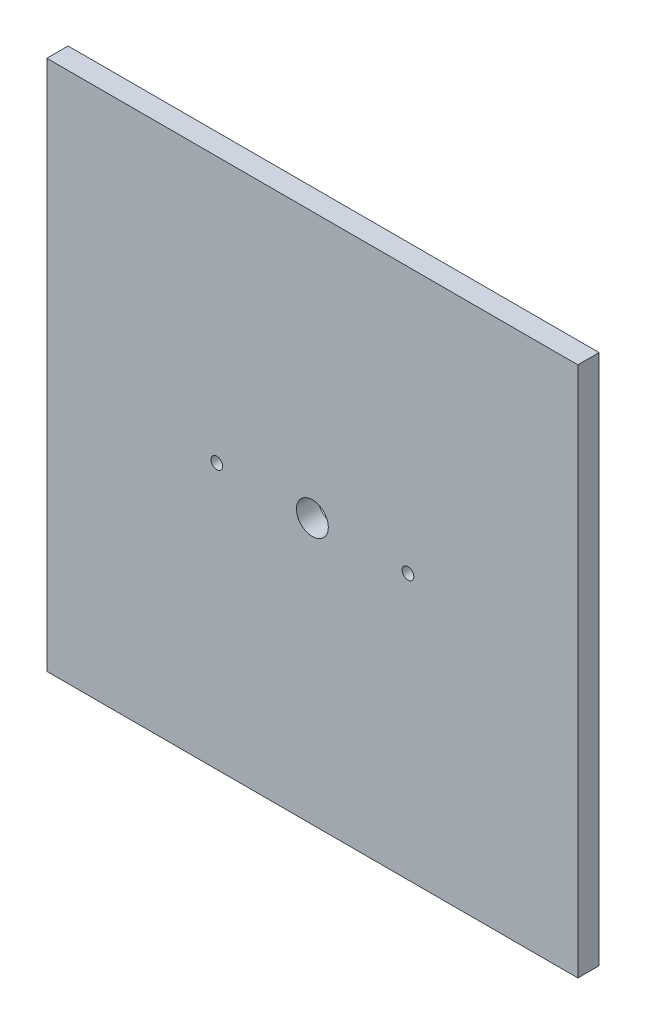
ISO-10303-21;
HEADER;
FILE_DESCRIPTION(('STEP AP214'),'2;1');
FILE_NAME('part.step','',(''),(''),'','','');
FILE_SCHEMA(('AUTOMOTIVE_DESIGN { 1 0 10303 214 1 1 1 1 }'));
ENDSEC;
DATA;
#1=APPLICATION_CONTEXT('core data for automotive mechanical design processes');
#2=APPLICATION_PROTOCOL_DEFINITION('international standard','automotive_design',2000,#1);
#3=PRODUCT_CONTEXT('',#1,'mechanical');
#4=PRODUCT('Part','Part','',(#3));
#5=PRODUCT_RELATED_PRODUCT_CATEGORY('part','',(#4));
#6=PRODUCT_DEFINITION_FORMATION('','',#4);
#7=PRODUCT_DEFINITION_CONTEXT('part definition',#1,'design');
#8=PRODUCT_DEFINITION('design','',#6,#7);
#9=PRODUCT_DEFINITION_SHAPE('','',#8);
#10=(LENGTH_UNIT() NAMED_UNIT(*) SI_UNIT(.MILLI.,.METRE.));
#11=(NAMED_UNIT(*) PLANE_ANGLE_UNIT() SI_UNIT($,.RADIAN.));
#12=(NAMED_UNIT(*) SI_UNIT($,.STERADIAN.) SOLID_ANGLE_UNIT());
#13=UNCERTAINTY_MEASURE_WITH_UNIT(LENGTH_MEASURE(1.E-05),#10,'distance_accuracy_value','');
#14=(GEOMETRIC_REPRESENTATION_CONTEXT(3) GLOBAL_UNCERTAINTY_ASSIGNED_CONTEXT((#13)) GLOBAL_UNIT_ASSIGNED_CONTEXT((#10,
#11,#12)) REPRESENTATION_CONTEXT('',''));
#15=CARTESIAN_POINT('',(0.,0.,0.));
#16=DIRECTION('',(0.,0.,1.));
#17=DIRECTION('',(1.,0.,0.));
#18=AXIS2_PLACEMENT_3D('',#15,#16,#17);
#19=CARTESIAN_POINT('',(-125.,-125.,10.));
#20=DIRECTION('',(1.,0.,0.));
#21=DIRECTION('',(0.,0.,-1.));
#22=AXIS2_PLACEMENT_3D('',#19,#20,#21);
#23=PLANE('',#22);
#24=DIRECTION('',(0.,-1.,0.));
#25=VECTOR('',#24,1.);
#26=CARTESIAN_POINT('',(-125.,-125.,0.));
#27=LINE('',#26,#25);
#28=CARTESIAN_POINT('',(-125.,125.,0.));
#29=VERTEX_POINT('',#28);
#30=CARTESIAN_POINT('',(-125.,-125.,0.));
#31=VERTEX_POINT('',#30);
#32=EDGE_CURVE('E107',#29,#31,#27,.T.);
#33=ORIENTED_EDGE('',*,*,#32,.T.);
#34=DIRECTION('',(0.,0.,-1.));
#35=VECTOR('',#34,1.);
#36=CARTESIAN_POINT('',(-125.,-125.,10.));
#37=LINE('',#36,#35);
#38=CARTESIAN_POINT('',(-125.,-125.,10.));
#39=VERTEX_POINT('',#38);
#40=EDGE_CURVE('E11',#39,#31,#37,.T.);
#41=ORIENTED_EDGE('',*,*,#40,.F.);
#42=DIRECTION('',(0.,-1.,0.));
#43=VECTOR('',#42,1.);
#44=CARTESIAN_POINT('',(-125.,-125.,10.));
#45=LINE('',#44,#43);
#46=CARTESIAN_POINT('',(-125.,125.,10.));
#47=VERTEX_POINT('',#46);
#48=EDGE_CURVE('E91',#47,#39,#45,.T.);
#49=ORIENTED_EDGE('',*,*,#48,.F.);
#50=DIRECTION('',(0.,0.,-1.));
#51=VECTOR('',#50,1.);
#52=CARTESIAN_POINT('',(-125.,125.,10.));
#53=LINE('',#52,#51);
#54=EDGE_CURVE('E103',#47,#29,#53,.T.);
#55=ORIENTED_EDGE('',*,*,#54,.T.);
#56=EDGE_LOOP('',(#33,#41,#49,#55));
#57=FACE_BOUND('',#56,.T.);
#58=ADVANCED_FACE('F39',(#57),#23,.F.);
#59=CARTESIAN_POINT('',(125.,-125.,10.));
#60=DIRECTION('',(0.,1.,0.));
#61=DIRECTION('',(0.,0.,1.));
#62=AXIS2_PLACEMENT_3D('',#59,#60,#61);
#63=PLANE('',#62);
#64=DIRECTION('',(1.,0.,0.));
#65=VECTOR('',#64,1.);
#66=CARTESIAN_POINT('',(125.,-125.,0.));
#67=LINE('',#66,#65);
#68=CARTESIAN_POINT('',(125.,-125.,0.));
#69=VERTEX_POINT('',#68);
#70=EDGE_CURVE('E96',#31,#69,#67,.T.);
#71=ORIENTED_EDGE('',*,*,#70,.T.);
#72=DIRECTION('',(0.,0.,-1.));
#73=VECTOR('',#72,1.);
#74=CARTESIAN_POINT('',(125.,-125.,10.));
#75=LINE('',#74,#73);
#76=CARTESIAN_POINT('',(125.,-125.,10.));
#77=VERTEX_POINT('',#76);
#78=EDGE_CURVE('E48',#77,#69,#75,.T.);
#79=ORIENTED_EDGE('',*,*,#78,.F.);
#80=DIRECTION('',(1.,0.,0.));
#81=VECTOR('',#80,1.);
#82=CARTESIAN_POINT('',(125.,-125.,10.));
#83=LINE('',#82,#81);
#84=EDGE_CURVE('E86',#39,#77,#83,.T.);
#85=ORIENTED_EDGE('',*,*,#84,.F.);
#86=ORIENTED_EDGE('',*,*,#40,.T.);
#87=EDGE_LOOP('',(#71,#79,#85,#86));
#88=FACE_BOUND('',#87,.T.);
#89=ADVANCED_FACE('F95',(#88),#63,.F.);
#90=CARTESIAN_POINT('',(125.,-125.,10.));
#91=DIRECTION('',(-1.,0.,0.));
#92=DIRECTION('',(0.,0.,1.));
#93=AXIS2_PLACEMENT_3D('',#90,#91,#92);
#94=PLANE('',#93);
#95=DIRECTION('',(0.,1.,0.));
#96=VECTOR('',#95,1.);
#97=CARTESIAN_POINT('',(125.,-125.,0.));
#98=LINE('',#97,#96);
#99=CARTESIAN_POINT('',(125.,125.,0.));
#100=VERTEX_POINT('',#99);
#101=EDGE_CURVE('E73',#69,#100,#98,.T.);
#102=ORIENTED_EDGE('',*,*,#101,.T.);
#103=DIRECTION('',(0.,0.,-1.));
#104=VECTOR('',#103,1.);
#105=CARTESIAN_POINT('',(125.,125.,10.));
#106=LINE('',#105,#104);
#107=CARTESIAN_POINT('',(125.,125.,10.));
#108=VERTEX_POINT('',#107);
#109=EDGE_CURVE('E98',#108,#100,#106,.T.);
#110=ORIENTED_EDGE('',*,*,#109,.F.);
#111=DIRECTION('',(0.,1.,0.));
#112=VECTOR('',#111,1.);
#113=CARTESIAN_POINT('',(125.,-125.,10.));
#114=LINE('',#113,#112);
#115=EDGE_CURVE('E89',#77,#108,#114,.T.);
#116=ORIENTED_EDGE('',*,*,#115,.F.);
#117=ORIENTED_EDGE('',*,*,#78,.T.);
#118=EDGE_LOOP('',(#102,#110,#116,#117));
#119=FACE_BOUND('',#118,.T.);
#120=ADVANCED_FACE('F99',(#119),#94,.F.);
#121=CARTESIAN_POINT('',(125.,125.,10.));
#122=DIRECTION('',(0.,-1.,0.));
#123=DIRECTION('',(1.,0.,0.));
#124=AXIS2_PLACEMENT_3D('',#121,#122,#123);
#125=PLANE('',#124);
#126=DIRECTION('',(-1.,0.,0.));
#127=VECTOR('',#126,1.);
#128=CARTESIAN_POINT('',(125.,125.,0.));
#129=LINE('',#128,#127);
#130=EDGE_CURVE('E79',#100,#29,#129,.T.);
#131=ORIENTED_EDGE('',*,*,#130,.T.);
#132=ORIENTED_EDGE('',*,*,#54,.F.);
#133=DIRECTION('',(-1.,0.,0.));
#134=VECTOR('',#133,1.);
#135=CARTESIAN_POINT('',(125.,125.,10.));
#136=LINE('',#135,#134);
#137=EDGE_CURVE('E56',#108,#47,#136,.T.);
#138=ORIENTED_EDGE('',*,*,#137,.F.);
#139=ORIENTED_EDGE('',*,*,#109,.T.);
#140=EDGE_LOOP('',(#131,#132,#138,#139));
#141=FACE_BOUND('',#140,.T.);
#142=ADVANCED_FACE('F121',(#141),#125,.F.);
#143=CARTESIAN_POINT('',(0.,0.,10.));
#144=DIRECTION('',(0.,0.,1.));
#145=DIRECTION('',(1.,0.,0.));
#146=AXIS2_PLACEMENT_3D('',#143,#144,#145);
#147=PLANE('',#146);
#148=CARTESIAN_POINT('',(0.,0.,10.));
#149=DIRECTION('',(0.,0.,1.));
#150=DIRECTION('',(1.,0.,0.));
#151=AXIS2_PLACEMENT_3D('',#148,#149,#150);
#152=CIRCLE('',#151,7.5);
#153=CARTESIAN_POINT('',(7.5,0.,10.));
#154=VERTEX_POINT('',#153);
#155=EDGE_CURVE('E147',#154,#154,#152,.T.);
#156=ORIENTED_EDGE('',*,*,#155,.F.);
#157=EDGE_LOOP('',(#156));
#158=FACE_BOUND('',#157,.T.);
#159=CARTESIAN_POINT('',(45.,0.,10.));
#160=DIRECTION('',(0.,0.,1.));
#161=DIRECTION('',(1.,0.,0.));
#162=AXIS2_PLACEMENT_3D('',#159,#160,#161);
#163=CIRCLE('',#162,2.74999999999999);
#164=CARTESIAN_POINT('',(47.75,0.,10.));
#165=VERTEX_POINT('',#164);
#166=EDGE_CURVE('E139',#165,#165,#163,.T.);
#167=ORIENTED_EDGE('',*,*,#166,.F.);
#168=EDGE_LOOP('',(#167));
#169=FACE_BOUND('',#168,.T.);
#170=CARTESIAN_POINT('',(-45.,0.,10.));
#171=DIRECTION('',(0.,0.,1.));
#172=DIRECTION('',(1.,0.,0.));
#173=AXIS2_PLACEMENT_3D('',#170,#171,#172);
#174=CIRCLE('',#173,2.74999999999999);
#175=CARTESIAN_POINT('',(-42.25,0.,10.));
#176=VERTEX_POINT('',#175);
#177=EDGE_CURVE('E131',#176,#176,#174,.T.);
#178=ORIENTED_EDGE('',*,*,#177,.F.);
#179=EDGE_LOOP('',(#178));
#180=FACE_BOUND('',#179,.T.);
#181=ORIENTED_EDGE('',*,*,#48,.T.);
#182=ORIENTED_EDGE('',*,*,#84,.T.);
#183=ORIENTED_EDGE('',*,*,#115,.T.);
#184=ORIENTED_EDGE('',*,*,#137,.T.);
#185=EDGE_LOOP('',(#181,#182,#183,#184));
#186=FACE_BOUND('',#185,.T.);
#187=ADVANCED_FACE('F87',(#158,#169,#180,#186),#147,.T.);
#188=CARTESIAN_POINT('',(0.,0.,0.));
#189=DIRECTION('',(0.,0.,1.));
#190=DIRECTION('',(1.,0.,0.));
#191=AXIS2_PLACEMENT_3D('',#188,#189,#190);
#192=PLANE('',#191);
#193=CARTESIAN_POINT('',(0.,0.,0.));
#194=DIRECTION('',(0.,0.,1.));
#195=DIRECTION('',(1.,0.,0.));
#196=AXIS2_PLACEMENT_3D('',#193,#194,#195);
#197=CIRCLE('',#196,7.5);
#198=CARTESIAN_POINT('',(7.5,0.,0.));
#199=VERTEX_POINT('',#198);
#200=EDGE_CURVE('E143',#199,#199,#197,.T.);
#201=ORIENTED_EDGE('',*,*,#200,.T.);
#202=EDGE_LOOP('',(#201));
#203=FACE_BOUND('',#202,.T.);
#204=CARTESIAN_POINT('',(45.,0.,0.));
#205=DIRECTION('',(0.,0.,1.));
#206=DIRECTION('',(1.,0.,0.));
#207=AXIS2_PLACEMENT_3D('',#204,#205,#206);
#208=CIRCLE('',#207,2.75);
#209=CARTESIAN_POINT('',(47.75,0.,0.));
#210=VERTEX_POINT('',#209);
#211=EDGE_CURVE('E135',#210,#210,#208,.T.);
#212=ORIENTED_EDGE('',*,*,#211,.T.);
#213=EDGE_LOOP('',(#212));
#214=FACE_BOUND('',#213,.T.);
#215=CARTESIAN_POINT('',(-45.,0.,0.));
#216=DIRECTION('',(0.,0.,1.));
#217=DIRECTION('',(1.,0.,0.));
#218=AXIS2_PLACEMENT_3D('',#215,#216,#217);
#219=CIRCLE('',#218,2.75);
#220=CARTESIAN_POINT('',(-42.25,0.,0.));
#221=VERTEX_POINT('',#220);
#222=EDGE_CURVE('E111',#221,#221,#219,.T.);
#223=ORIENTED_EDGE('',*,*,#222,.T.);
#224=EDGE_LOOP('',(#223));
#225=FACE_BOUND('',#224,.T.);
#226=ORIENTED_EDGE('',*,*,#32,.F.);
#227=ORIENTED_EDGE('',*,*,#130,.F.);
#228=ORIENTED_EDGE('',*,*,#101,.F.);
#229=ORIENTED_EDGE('',*,*,#70,.F.);
#230=EDGE_LOOP('',(#226,#227,#228,#229));
#231=FACE_BOUND('',#230,.T.);
#232=ADVANCED_FACE('F124',(#203,#214,#225,#231),#192,.F.);
#233=CARTESIAN_POINT('',(-45.,0.,10.));
#234=DIRECTION('',(0.,0.,1.));
#235=DIRECTION('',(1.,0.,0.));
#236=AXIS2_PLACEMENT_3D('',#233,#234,#235);
#237=CYLINDRICAL_SURFACE('',#236,2.74999999999999);
#238=ORIENTED_EDGE('',*,*,#222,.F.);
#239=EDGE_LOOP('',(#238));
#240=FACE_BOUND('',#239,.T.);
#241=ORIENTED_EDGE('',*,*,#177,.T.);
#242=EDGE_LOOP('',(#241));
#243=FACE_BOUND('',#242,.T.);
#244=ADVANCED_FACE('F161',(#240,#243),#237,.F.);
#245=CARTESIAN_POINT('',(45.,0.,10.));
#246=DIRECTION('',(0.,0.,1.));
#247=DIRECTION('',(1.,0.,0.));
#248=AXIS2_PLACEMENT_3D('',#245,#246,#247);
#249=CYLINDRICAL_SURFACE('',#248,2.74999999999999);
#250=ORIENTED_EDGE('',*,*,#211,.F.);
#251=EDGE_LOOP('',(#250));
#252=FACE_BOUND('',#251,.T.);
#253=ORIENTED_EDGE('',*,*,#166,.T.);
#254=EDGE_LOOP('',(#253));
#255=FACE_BOUND('',#254,.T.);
#256=ADVANCED_FACE('F163',(#252,#255),#249,.F.);
#257=CARTESIAN_POINT('',(0.,0.,10.));
#258=DIRECTION('',(0.,0.,1.));
#259=DIRECTION('',(1.,0.,0.));
#260=AXIS2_PLACEMENT_3D('',#257,#258,#259);
#261=CYLINDRICAL_SURFACE('',#260,7.5);
#262=ORIENTED_EDGE('',*,*,#200,.F.);
#263=EDGE_LOOP('',(#262));
#264=FACE_BOUND('',#263,.T.);
#265=ORIENTED_EDGE('',*,*,#155,.T.);
#266=EDGE_LOOP('',(#265));
#267=FACE_BOUND('',#266,.T.);
#268=ADVANCED_FACE('F152',(#264,#267),#261,.F.);
#269=CLOSED_SHELL('',(#58,#89,#120,#142,#187,#232,#244,#256,#268));
#270=MANIFOLD_SOLID_BREP('B2',#269);
#271=ADVANCED_BREP_SHAPE_REPRESENTATION('',(#18,#270),#14);
#272=SHAPE_DEFINITION_REPRESENTATION(#9,#271);
ENDSEC;
END-ISO-10303-21;
